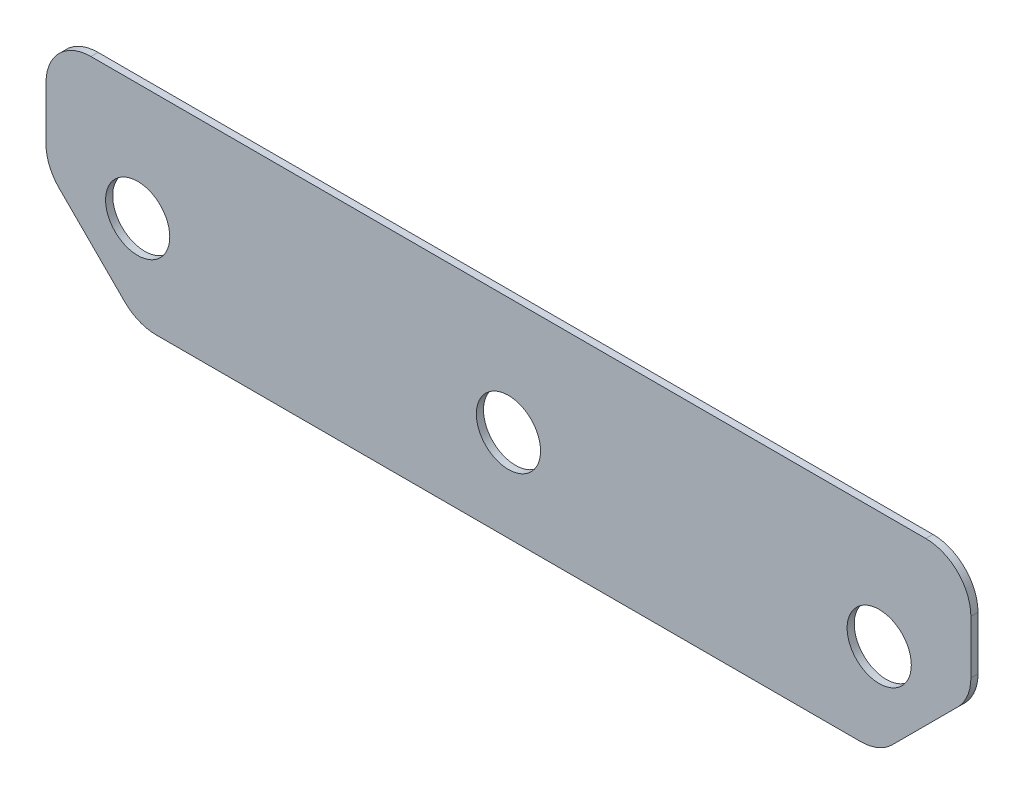
ISO-10303-21;
HEADER;
FILE_DESCRIPTION(('STEP AP214'),'2;1');
FILE_NAME('part.step','',(''),(''),'','','');
FILE_SCHEMA(('AUTOMOTIVE_DESIGN { 1 0 10303 214 1 1 1 1 }'));
ENDSEC;
DATA;
#1=APPLICATION_CONTEXT('core data for automotive mechanical design processes');
#2=APPLICATION_PROTOCOL_DEFINITION('international standard','automotive_design',2000,#1);
#3=PRODUCT_CONTEXT('',#1,'mechanical');
#4=PRODUCT('Part','Part','',(#3));
#5=PRODUCT_RELATED_PRODUCT_CATEGORY('part','',(#4));
#6=PRODUCT_DEFINITION_FORMATION('','',#4);
#7=PRODUCT_DEFINITION_CONTEXT('part definition',#1,'design');
#8=PRODUCT_DEFINITION('design','',#6,#7);
#9=PRODUCT_DEFINITION_SHAPE('','',#8);
#10=(LENGTH_UNIT() NAMED_UNIT(*) SI_UNIT(.MILLI.,.METRE.));
#11=(NAMED_UNIT(*) PLANE_ANGLE_UNIT() SI_UNIT($,.RADIAN.));
#12=(NAMED_UNIT(*) SI_UNIT($,.STERADIAN.) SOLID_ANGLE_UNIT());
#13=UNCERTAINTY_MEASURE_WITH_UNIT(LENGTH_MEASURE(1.E-05),#10,'distance_accuracy_value','');
#14=(GEOMETRIC_REPRESENTATION_CONTEXT(3) GLOBAL_UNCERTAINTY_ASSIGNED_CONTEXT((#13)) GLOBAL_UNIT_ASSIGNED_CONTEXT((#10,
#11,#12)) REPRESENTATION_CONTEXT('',''));
#15=CARTESIAN_POINT('',(0.,0.,0.));
#16=DIRECTION('',(0.,0.,1.));
#17=DIRECTION('',(1.,0.,0.));
#18=AXIS2_PLACEMENT_3D('',#15,#16,#17);
#19=CARTESIAN_POINT('',(-102.9119,-102.9119,3.175));
#20=DIRECTION('',(0.707106781186548,0.707106781186548,0.));
#21=DIRECTION('',(-0.707106781186548,0.707106781186548,0.));
#22=AXIS2_PLACEMENT_3D('',#19,#20,#21);
#23=PLANE('',#22);
#24=DIRECTION('',(0.707106781186548,-0.707106781186548,0.));
#25=VECTOR('',#24,1.);
#26=CARTESIAN_POINT('',(-102.9119,-102.9119,3.175));
#27=LINE('',#26,#25);
#28=CARTESIAN_POINT('',(-199.965935623731,-5.85786437626903,3.175));
#29=VERTEX_POINT('',#28);
#30=CARTESIAN_POINT('',(-170.881664376269,-34.9421356237309,3.175));
#31=VERTEX_POINT('',#30);
#32=EDGE_CURVE('E264',#29,#31,#27,.T.);
#33=ORIENTED_EDGE('',*,*,#32,.F.);
#34=DIRECTION('',(0.,0.,-1.));
#35=VECTOR('',#34,1.);
#36=CARTESIAN_POINT('',(-199.965935623731,-5.85786437626904,0.));
#37=LINE('',#36,#35);
#38=CARTESIAN_POINT('',(-199.965935623731,-5.85786437626903,0.));
#39=VERTEX_POINT('',#38);
#40=EDGE_CURVE('E191',#29,#39,#37,.T.);
#41=ORIENTED_EDGE('',*,*,#40,.T.);
#42=DIRECTION('',(0.707106781186548,-0.707106781186548,0.));
#43=VECTOR('',#42,1.);
#44=CARTESIAN_POINT('',(-102.9119,-102.9119,0.));
#45=LINE('',#44,#43);
#46=CARTESIAN_POINT('',(-170.881664376269,-34.9421356237309,0.));
#47=VERTEX_POINT('',#46);
#48=EDGE_CURVE('E249',#39,#47,#45,.T.);
#49=ORIENTED_EDGE('',*,*,#48,.T.);
#50=DIRECTION('',(0.,0.,-1.));
#51=VECTOR('',#50,1.);
#52=CARTESIAN_POINT('',(-170.881664376269,-34.942135623731,3.175));
#53=LINE('',#52,#51);
#54=EDGE_CURVE('E188',#47,#31,#53,.F.);
#55=ORIENTED_EDGE('',*,*,#54,.T.);
#56=EDGE_LOOP('',(#33,#41,#49,#55));
#57=FACE_BOUND('',#56,.T.);
#58=ADVANCED_FACE('F39',(#57),#23,.F.);
#59=CARTESIAN_POINT('',(0.,-40.8,3.175));
#60=DIRECTION('',(0.,1.,0.));
#61=DIRECTION('',(-1.,0.,0.));
#62=AXIS2_PLACEMENT_3D('',#59,#60,#61);
#63=PLANE('',#62);
#64=DIRECTION('',(1.,0.,0.));
#65=VECTOR('',#64,1.);
#66=CARTESIAN_POINT('',(0.,-40.8,3.175));
#67=LINE('',#66,#65);
#68=CARTESIAN_POINT('',(-156.739528752538,-40.8,3.175));
#69=VERTEX_POINT('',#68);
#70=CARTESIAN_POINT('',(156.739528752538,-40.7999999999999,3.175));
#71=VERTEX_POINT('',#70);
#72=EDGE_CURVE('E270',#69,#71,#67,.T.);
#73=ORIENTED_EDGE('',*,*,#72,.F.);
#74=DIRECTION('',(0.,0.,-1.));
#75=VECTOR('',#74,1.);
#76=CARTESIAN_POINT('',(-156.739528752538,-40.8,3.175));
#77=LINE('',#76,#75);
#78=CARTESIAN_POINT('',(-156.739528752538,-40.8,0.));
#79=VERTEX_POINT('',#78);
#80=EDGE_CURVE('E222',#69,#79,#77,.T.);
#81=ORIENTED_EDGE('',*,*,#80,.T.);
#82=DIRECTION('',(1.,0.,0.));
#83=VECTOR('',#82,1.);
#84=CARTESIAN_POINT('',(0.,-40.8,0.));
#85=LINE('',#84,#83);
#86=CARTESIAN_POINT('',(156.739528752538,-40.7999999999999,0.));
#87=VERTEX_POINT('',#86);
#88=EDGE_CURVE('E244',#79,#87,#85,.T.);
#89=ORIENTED_EDGE('',*,*,#88,.T.);
#90=DIRECTION('',(0.,0.,-1.));
#91=VECTOR('',#90,1.);
#92=CARTESIAN_POINT('',(156.739528752538,-40.7999999999999,3.175));
#93=LINE('',#92,#91);
#94=EDGE_CURVE('E219',#87,#71,#93,.F.);
#95=ORIENTED_EDGE('',*,*,#94,.T.);
#96=EDGE_LOOP('',(#73,#81,#89,#95));
#97=FACE_BOUND('',#96,.T.);
#98=ADVANCED_FACE('F306',(#97),#63,.F.);
#99=CARTESIAN_POINT('',(102.9119,-102.9119,3.175));
#100=DIRECTION('',(0.707106781186548,-0.707106781186548,0.));
#101=DIRECTION('',(0.707106781186548,0.707106781186548,0.));
#102=AXIS2_PLACEMENT_3D('',#99,#100,#101);
#103=PLANE('',#102);
#104=DIRECTION('',(-0.707106781186548,-0.707106781186548,0.));
#105=VECTOR('',#104,1.);
#106=CARTESIAN_POINT('',(102.9119,-102.9119,3.175));
#107=LINE('',#106,#105);
#108=CARTESIAN_POINT('',(199.965935623731,-5.85786437626899,3.175));
#109=VERTEX_POINT('',#108);
#110=CARTESIAN_POINT('',(170.881664376269,-34.9421356237309,3.175));
#111=VERTEX_POINT('',#110);
#112=EDGE_CURVE('E237',#109,#111,#107,.T.);
#113=ORIENTED_EDGE('',*,*,#112,.T.);
#114=DIRECTION('',(0.,0.,-1.));
#115=VECTOR('',#114,1.);
#116=CARTESIAN_POINT('',(170.881664376269,-34.9421356237309,0.));
#117=LINE('',#116,#115);
#118=CARTESIAN_POINT('',(170.881664376269,-34.9421356237309,0.));
#119=VERTEX_POINT('',#118);
#120=EDGE_CURVE('E48',#111,#119,#117,.T.);
#121=ORIENTED_EDGE('',*,*,#120,.T.);
#122=DIRECTION('',(-0.707106781186548,-0.707106781186548,0.));
#123=VECTOR('',#122,1.);
#124=CARTESIAN_POINT('',(102.9119,-102.9119,0.));
#125=LINE('',#124,#123);
#126=CARTESIAN_POINT('',(199.965935623731,-5.85786437626899,0.));
#127=VERTEX_POINT('',#126);
#128=EDGE_CURVE('E235',#127,#119,#125,.T.);
#129=ORIENTED_EDGE('',*,*,#128,.F.);
#130=DIRECTION('',(0.,0.,-1.));
#131=VECTOR('',#130,1.);
#132=CARTESIAN_POINT('',(199.965935623731,-5.85786437626901,3.175));
#133=LINE('',#132,#131);
#134=EDGE_CURVE('E226',#127,#109,#133,.F.);
#135=ORIENTED_EDGE('',*,*,#134,.T.);
#136=EDGE_LOOP('',(#113,#121,#129,#135));
#137=FACE_BOUND('',#136,.T.);
#138=ADVANCED_FACE('F234',(#137),#103,.T.);
#139=CARTESIAN_POINT('',(205.8238,0.,3.175));
#140=DIRECTION('',(1.,0.,0.));
#141=DIRECTION('',(0.,0.,-1.));
#142=AXIS2_PLACEMENT_3D('',#139,#140,#141);
#143=PLANE('',#142);
#144=DIRECTION('',(0.,-1.,0.));
#145=VECTOR('',#144,1.);
#146=CARTESIAN_POINT('',(205.8238,0.,3.175));
#147=LINE('',#146,#145);
#148=CARTESIAN_POINT('',(205.8238,32.,3.175));
#149=VERTEX_POINT('',#148);
#150=CARTESIAN_POINT('',(205.8238,8.28427124746196,3.175));
#151=VERTEX_POINT('',#150);
#152=EDGE_CURVE('E277',#149,#151,#147,.T.);
#153=ORIENTED_EDGE('',*,*,#152,.T.);
#154=DIRECTION('',(0.,0.,-1.));
#155=VECTOR('',#154,1.);
#156=CARTESIAN_POINT('',(205.8238,8.28427124746196,3.175));
#157=LINE('',#156,#155);
#158=CARTESIAN_POINT('',(205.8238,8.28427124746196,0.));
#159=VERTEX_POINT('',#158);
#160=EDGE_CURVE('E11',#151,#159,#157,.T.);
#161=ORIENTED_EDGE('',*,*,#160,.T.);
#162=DIRECTION('',(0.,-1.,0.));
#163=VECTOR('',#162,1.);
#164=CARTESIAN_POINT('',(205.8238,0.,0.));
#165=LINE('',#164,#163);
#166=CARTESIAN_POINT('',(205.8238,32.,0.));
#167=VERTEX_POINT('',#166);
#168=EDGE_CURVE('E243',#167,#159,#165,.T.);
#169=ORIENTED_EDGE('',*,*,#168,.F.);
#170=DIRECTION('',(0.,0.,-1.));
#171=VECTOR('',#170,1.);
#172=CARTESIAN_POINT('',(205.8238,32.,3.175));
#173=LINE('',#172,#171);
#174=EDGE_CURVE('E185',#167,#149,#173,.F.);
#175=ORIENTED_EDGE('',*,*,#174,.T.);
#176=EDGE_LOOP('',(#153,#161,#169,#175));
#177=FACE_BOUND('',#176,.T.);
#178=ADVANCED_FACE('F348',(#177),#143,.T.);
#179=CARTESIAN_POINT('',(0.,52.,3.175));
#180=DIRECTION('',(0.,1.,0.));
#181=DIRECTION('',(0.,0.,1.));
#182=AXIS2_PLACEMENT_3D('',#179,#180,#181);
#183=PLANE('',#182);
#184=DIRECTION('',(1.,0.,0.));
#185=VECTOR('',#184,1.);
#186=CARTESIAN_POINT('',(0.,52.,0.));
#187=LINE('',#186,#185);
#188=CARTESIAN_POINT('',(-185.8238,52.,0.));
#189=VERTEX_POINT('',#188);
#190=CARTESIAN_POINT('',(185.8238,52.,0.));
#191=VERTEX_POINT('',#190);
#192=EDGE_CURVE('E144',#189,#191,#187,.T.);
#193=ORIENTED_EDGE('',*,*,#192,.F.);
#194=DIRECTION('',(0.,0.,-1.));
#195=VECTOR('',#194,1.);
#196=CARTESIAN_POINT('',(-185.8238,52.,3.175));
#197=LINE('',#196,#195);
#198=CARTESIAN_POINT('',(-185.8238,52.,3.175));
#199=VERTEX_POINT('',#198);
#200=EDGE_CURVE('E152',#189,#199,#197,.F.);
#201=ORIENTED_EDGE('',*,*,#200,.T.);
#202=DIRECTION('',(1.,0.,0.));
#203=VECTOR('',#202,1.);
#204=CARTESIAN_POINT('',(0.,52.,3.175));
#205=LINE('',#204,#203);
#206=CARTESIAN_POINT('',(185.8238,52.,3.175));
#207=VERTEX_POINT('',#206);
#208=EDGE_CURVE('E280',#199,#207,#205,.T.);
#209=ORIENTED_EDGE('',*,*,#208,.T.);
#210=DIRECTION('',(0.,0.,-1.));
#211=VECTOR('',#210,1.);
#212=CARTESIAN_POINT('',(185.8238,52.,3.175));
#213=LINE('',#212,#211);
#214=EDGE_CURVE('E154',#207,#191,#213,.T.);
#215=ORIENTED_EDGE('',*,*,#214,.T.);
#216=EDGE_LOOP('',(#193,#201,#209,#215));
#217=FACE_BOUND('',#216,.T.);
#218=ADVANCED_FACE('F344',(#217),#183,.T.);
#219=CARTESIAN_POINT('',(0.,0.,3.175));
#220=DIRECTION('',(0.,0.,-1.));
#221=DIRECTION('',(-1.,0.,0.));
#222=AXIS2_PLACEMENT_3D('',#219,#220,#221);
#223=CYLINDRICAL_SURFACE('',#222,14.2875);
#224=CARTESIAN_POINT('',(0.,0.,3.175));
#225=DIRECTION('',(0.,0.,1.));
#226=DIRECTION('',(1.,0.,0.));
#227=AXIS2_PLACEMENT_3D('',#224,#225,#226);
#228=CIRCLE('',#227,14.2875);
#229=CARTESIAN_POINT('',(14.2875,0.,3.175));
#230=VERTEX_POINT('',#229);
#231=EDGE_CURVE('E168',#230,#230,#228,.T.);
#232=ORIENTED_EDGE('',*,*,#231,.T.);
#233=EDGE_LOOP('',(#232));
#234=FACE_BOUND('',#233,.T.);
#235=CARTESIAN_POINT('',(0.,0.,0.));
#236=DIRECTION('',(0.,0.,1.));
#237=DIRECTION('',(1.,0.,0.));
#238=AXIS2_PLACEMENT_3D('',#235,#236,#237);
#239=CIRCLE('',#238,14.2875);
#240=CARTESIAN_POINT('',(14.2875,0.,0.));
#241=VERTEX_POINT('',#240);
#242=EDGE_CURVE('E143',#241,#241,#239,.T.);
#243=ORIENTED_EDGE('',*,*,#242,.F.);
#244=EDGE_LOOP('',(#243));
#245=FACE_BOUND('',#244,.T.);
#246=ADVANCED_FACE('F356',(#234,#245),#223,.F.);
#247=CARTESIAN_POINT('',(-205.8238,0.,3.175));
#248=DIRECTION('',(-1.,0.,0.));
#249=DIRECTION('',(0.,0.,1.));
#250=AXIS2_PLACEMENT_3D('',#247,#248,#249);
#251=PLANE('',#250);
#252=DIRECTION('',(0.,1.,0.));
#253=VECTOR('',#252,1.);
#254=CARTESIAN_POINT('',(-205.8238,0.,0.));
#255=LINE('',#254,#253);
#256=CARTESIAN_POINT('',(-205.8238,8.28427124746192,0.));
#257=VERTEX_POINT('',#256);
#258=CARTESIAN_POINT('',(-205.8238,32.,0.));
#259=VERTEX_POINT('',#258);
#260=EDGE_CURVE('E130',#257,#259,#255,.T.);
#261=ORIENTED_EDGE('',*,*,#260,.F.);
#262=DIRECTION('',(0.,0.,-1.));
#263=VECTOR('',#262,1.);
#264=CARTESIAN_POINT('',(-205.8238,8.28427124746192,3.175));
#265=LINE('',#264,#263);
#266=CARTESIAN_POINT('',(-205.8238,8.28427124746192,3.175));
#267=VERTEX_POINT('',#266);
#268=EDGE_CURVE('E206',#257,#267,#265,.F.);
#269=ORIENTED_EDGE('',*,*,#268,.T.);
#270=DIRECTION('',(0.,1.,0.));
#271=VECTOR('',#270,1.);
#272=CARTESIAN_POINT('',(-205.8238,0.,3.175));
#273=LINE('',#272,#271);
#274=CARTESIAN_POINT('',(-205.8238,32.,3.175));
#275=VERTEX_POINT('',#274);
#276=EDGE_CURVE('E159',#267,#275,#273,.T.);
#277=ORIENTED_EDGE('',*,*,#276,.T.);
#278=DIRECTION('',(0.,0.,-1.));
#279=VECTOR('',#278,1.);
#280=CARTESIAN_POINT('',(-205.8238,32.,3.175));
#281=LINE('',#280,#279);
#282=EDGE_CURVE('E151',#275,#259,#281,.T.);
#283=ORIENTED_EDGE('',*,*,#282,.T.);
#284=EDGE_LOOP('',(#261,#269,#277,#283));
#285=FACE_BOUND('',#284,.T.);
#286=ADVANCED_FACE('F157',(#285),#251,.T.);
#287=CARTESIAN_POINT('',(-165.0238,0.,3.175));
#288=DIRECTION('',(0.,0.,-1.));
#289=DIRECTION('',(-1.,0.,0.));
#290=AXIS2_PLACEMENT_3D('',#287,#288,#289);
#291=CYLINDRICAL_SURFACE('',#290,14.2875);
#292=CARTESIAN_POINT('',(-165.0238,0.,3.175));
#293=DIRECTION('',(0.,0.,1.));
#294=DIRECTION('',(1.,0.,0.));
#295=AXIS2_PLACEMENT_3D('',#292,#293,#294);
#296=CIRCLE('',#295,14.2875);
#297=CARTESIAN_POINT('',(-150.7363,0.,3.175));
#298=VERTEX_POINT('',#297);
#299=EDGE_CURVE('E259',#298,#298,#296,.T.);
#300=ORIENTED_EDGE('',*,*,#299,.T.);
#301=EDGE_LOOP('',(#300));
#302=FACE_BOUND('',#301,.T.);
#303=CARTESIAN_POINT('',(-165.0238,0.,0.));
#304=DIRECTION('',(0.,0.,1.));
#305=DIRECTION('',(1.,0.,0.));
#306=AXIS2_PLACEMENT_3D('',#303,#304,#305);
#307=CIRCLE('',#306,14.2875);
#308=CARTESIAN_POINT('',(-150.7363,0.,0.));
#309=VERTEX_POINT('',#308);
#310=EDGE_CURVE('E289',#309,#309,#307,.T.);
#311=ORIENTED_EDGE('',*,*,#310,.F.);
#312=EDGE_LOOP('',(#311));
#313=FACE_BOUND('',#312,.T.);
#314=ADVANCED_FACE('F325',(#302,#313),#291,.F.);
#315=CARTESIAN_POINT('',(165.0238,0.,3.175));
#316=DIRECTION('',(0.,0.,-1.));
#317=DIRECTION('',(-1.,0.,0.));
#318=AXIS2_PLACEMENT_3D('',#315,#316,#317);
#319=CYLINDRICAL_SURFACE('',#318,14.2875);
#320=CARTESIAN_POINT('',(165.0238,0.,3.175));
#321=DIRECTION('',(0.,0.,1.));
#322=DIRECTION('',(1.,0.,0.));
#323=AXIS2_PLACEMENT_3D('',#320,#321,#322);
#324=CIRCLE('',#323,14.2875);
#325=CARTESIAN_POINT('',(179.3113,0.,3.175));
#326=VERTEX_POINT('',#325);
#327=EDGE_CURVE('E162',#326,#326,#324,.T.);
#328=ORIENTED_EDGE('',*,*,#327,.T.);
#329=EDGE_LOOP('',(#328));
#330=FACE_BOUND('',#329,.T.);
#331=CARTESIAN_POINT('',(165.0238,0.,0.));
#332=DIRECTION('',(0.,0.,1.));
#333=DIRECTION('',(1.,0.,0.));
#334=AXIS2_PLACEMENT_3D('',#331,#332,#333);
#335=CIRCLE('',#334,14.2875);
#336=CARTESIAN_POINT('',(179.3113,0.,0.));
#337=VERTEX_POINT('',#336);
#338=EDGE_CURVE('E171',#337,#337,#335,.T.);
#339=ORIENTED_EDGE('',*,*,#338,.F.);
#340=EDGE_LOOP('',(#339));
#341=FACE_BOUND('',#340,.T.);
#342=ADVANCED_FACE('F328',(#330,#341),#319,.F.);
#343=CARTESIAN_POINT('',(0.,0.,3.175));
#344=DIRECTION('',(0.,0.,1.));
#345=DIRECTION('',(1.,0.,0.));
#346=AXIS2_PLACEMENT_3D('',#343,#344,#345);
#347=PLANE('',#346);
#348=ORIENTED_EDGE('',*,*,#299,.F.);
#349=EDGE_LOOP('',(#348));
#350=FACE_BOUND('',#349,.T.);
#351=ORIENTED_EDGE('',*,*,#276,.F.);
#352=CARTESIAN_POINT('',(-185.8238,8.28427124746192,3.175));
#353=DIRECTION('',(0.,0.,1.));
#354=DIRECTION('',(1.,0.,0.));
#355=AXIS2_PLACEMENT_3D('',#352,#353,#354);
#356=CIRCLE('',#355,20.);
#357=EDGE_CURVE('E216',#267,#29,#356,.T.);
#358=ORIENTED_EDGE('',*,*,#357,.T.);
#359=ORIENTED_EDGE('',*,*,#32,.T.);
#360=CARTESIAN_POINT('',(-156.739528752538,-20.8,3.175));
#361=DIRECTION('',(0.,0.,1.));
#362=DIRECTION('',(1.,0.,0.));
#363=AXIS2_PLACEMENT_3D('',#360,#361,#362);
#364=CIRCLE('',#363,20.);
#365=EDGE_CURVE('E213',#31,#69,#364,.T.);
#366=ORIENTED_EDGE('',*,*,#365,.T.);
#367=ORIENTED_EDGE('',*,*,#72,.T.);
#368=CARTESIAN_POINT('',(156.739528752538,-20.7999999999999,3.175));
#369=DIRECTION('',(0.,0.,1.));
#370=DIRECTION('',(1.,0.,0.));
#371=AXIS2_PLACEMENT_3D('',#368,#369,#370);
#372=CIRCLE('',#371,20.);
#373=EDGE_CURVE('E61',#71,#111,#372,.T.);
#374=ORIENTED_EDGE('',*,*,#373,.T.);
#375=ORIENTED_EDGE('',*,*,#112,.F.);
#376=CARTESIAN_POINT('',(185.8238,8.28427124746196,3.175));
#377=DIRECTION('',(0.,0.,1.));
#378=DIRECTION('',(1.,0.,0.));
#379=AXIS2_PLACEMENT_3D('',#376,#377,#378);
#380=CIRCLE('',#379,20.);
#381=EDGE_CURVE('E55',#109,#151,#380,.T.);
#382=ORIENTED_EDGE('',*,*,#381,.T.);
#383=ORIENTED_EDGE('',*,*,#152,.F.);
#384=CARTESIAN_POINT('',(185.8238,32.,3.175));
#385=DIRECTION('',(0.,0.,1.));
#386=DIRECTION('',(1.,0.,0.));
#387=AXIS2_PLACEMENT_3D('',#384,#385,#386);
#388=CIRCLE('',#387,20.);
#389=EDGE_CURVE('E179',#149,#207,#388,.T.);
#390=ORIENTED_EDGE('',*,*,#389,.T.);
#391=ORIENTED_EDGE('',*,*,#208,.F.);
#392=CARTESIAN_POINT('',(-185.8238,32.,3.175));
#393=DIRECTION('',(0.,0.,1.));
#394=DIRECTION('',(1.,0.,0.));
#395=AXIS2_PLACEMENT_3D('',#392,#393,#394);
#396=CIRCLE('',#395,20.);
#397=EDGE_CURVE('E182',#199,#275,#396,.T.);
#398=ORIENTED_EDGE('',*,*,#397,.T.);
#399=EDGE_LOOP('',(#351,#358,#359,#366,#367,#374,#375,#382,#383,#390,#391,#398));
#400=FACE_BOUND('',#399,.T.);
#401=ORIENTED_EDGE('',*,*,#231,.F.);
#402=EDGE_LOOP('',(#401));
#403=FACE_BOUND('',#402,.T.);
#404=ORIENTED_EDGE('',*,*,#327,.F.);
#405=EDGE_LOOP('',(#404));
#406=FACE_BOUND('',#405,.T.);
#407=ADVANCED_FACE('F303',(#350,#400,#403,#406),#347,.T.);
#408=CARTESIAN_POINT('',(0.,0.,0.));
#409=DIRECTION('',(0.,0.,1.));
#410=DIRECTION('',(1.,0.,0.));
#411=AXIS2_PLACEMENT_3D('',#408,#409,#410);
#412=PLANE('',#411);
#413=ORIENTED_EDGE('',*,*,#310,.T.);
#414=EDGE_LOOP('',(#413));
#415=FACE_BOUND('',#414,.T.);
#416=ORIENTED_EDGE('',*,*,#48,.F.);
#417=CARTESIAN_POINT('',(-185.8238,8.28427124746192,0.));
#418=DIRECTION('',(0.,0.,1.));
#419=DIRECTION('',(1.,0.,0.));
#420=AXIS2_PLACEMENT_3D('',#417,#418,#419);
#421=CIRCLE('',#420,20.);
#422=EDGE_CURVE('E138',#39,#257,#421,.F.);
#423=ORIENTED_EDGE('',*,*,#422,.T.);
#424=ORIENTED_EDGE('',*,*,#260,.T.);
#425=CARTESIAN_POINT('',(-185.8238,32.,0.));
#426=DIRECTION('',(0.,0.,1.));
#427=DIRECTION('',(1.,0.,0.));
#428=AXIS2_PLACEMENT_3D('',#425,#426,#427);
#429=CIRCLE('',#428,20.);
#430=EDGE_CURVE('E136',#259,#189,#429,.F.);
#431=ORIENTED_EDGE('',*,*,#430,.T.);
#432=ORIENTED_EDGE('',*,*,#192,.T.);
#433=CARTESIAN_POINT('',(185.8238,32.,0.));
#434=DIRECTION('',(0.,0.,1.));
#435=DIRECTION('',(1.,0.,0.));
#436=AXIS2_PLACEMENT_3D('',#433,#434,#435);
#437=CIRCLE('',#436,20.);
#438=EDGE_CURVE('E155',#191,#167,#437,.F.);
#439=ORIENTED_EDGE('',*,*,#438,.T.);
#440=ORIENTED_EDGE('',*,*,#168,.T.);
#441=CARTESIAN_POINT('',(185.8238,8.28427124746196,0.));
#442=DIRECTION('',(0.,0.,1.));
#443=DIRECTION('',(1.,0.,0.));
#444=AXIS2_PLACEMENT_3D('',#441,#442,#443);
#445=CIRCLE('',#444,20.);
#446=EDGE_CURVE('E195',#159,#127,#445,.F.);
#447=ORIENTED_EDGE('',*,*,#446,.T.);
#448=ORIENTED_EDGE('',*,*,#128,.T.);
#449=CARTESIAN_POINT('',(156.739528752538,-20.7999999999999,0.));
#450=DIRECTION('',(0.,0.,1.));
#451=DIRECTION('',(1.,0.,0.));
#452=AXIS2_PLACEMENT_3D('',#449,#450,#451);
#453=CIRCLE('',#452,20.);
#454=EDGE_CURVE('E198',#119,#87,#453,.F.);
#455=ORIENTED_EDGE('',*,*,#454,.T.);
#456=ORIENTED_EDGE('',*,*,#88,.F.);
#457=CARTESIAN_POINT('',(-156.739528752538,-20.8,0.));
#458=DIRECTION('',(0.,0.,1.));
#459=DIRECTION('',(1.,0.,0.));
#460=AXIS2_PLACEMENT_3D('',#457,#458,#459);
#461=CIRCLE('',#460,20.);
#462=EDGE_CURVE('E201',#79,#47,#461,.F.);
#463=ORIENTED_EDGE('',*,*,#462,.T.);
#464=EDGE_LOOP('',(#416,#423,#424,#431,#432,#439,#440,#447,#448,#455,#456,#463));
#465=FACE_BOUND('',#464,.T.);
#466=ORIENTED_EDGE('',*,*,#242,.T.);
#467=EDGE_LOOP('',(#466));
#468=FACE_BOUND('',#467,.T.);
#469=ORIENTED_EDGE('',*,*,#338,.T.);
#470=EDGE_LOOP('',(#469));
#471=FACE_BOUND('',#470,.T.);
#472=ADVANCED_FACE('F133',(#415,#465,#468,#471),#412,.F.);
#473=CARTESIAN_POINT('',(-185.8238,32.,3.175));
#474=DIRECTION('',(0.,0.,-1.));
#475=DIRECTION('',(-1.,0.,0.));
#476=AXIS2_PLACEMENT_3D('',#473,#474,#475);
#477=CYLINDRICAL_SURFACE('',#476,20.);
#478=ORIENTED_EDGE('',*,*,#397,.F.);
#479=ORIENTED_EDGE('',*,*,#200,.F.);
#480=ORIENTED_EDGE('',*,*,#430,.F.);
#481=ORIENTED_EDGE('',*,*,#282,.F.);
#482=EDGE_LOOP('',(#478,#479,#480,#481));
#483=FACE_BOUND('',#482,.T.);
#484=ADVANCED_FACE('F150',(#483),#477,.T.);
#485=CARTESIAN_POINT('',(185.8238,32.,3.175));
#486=DIRECTION('',(0.,0.,-1.));
#487=DIRECTION('',(-1.,0.,0.));
#488=AXIS2_PLACEMENT_3D('',#485,#486,#487);
#489=CYLINDRICAL_SURFACE('',#488,20.);
#490=ORIENTED_EDGE('',*,*,#389,.F.);
#491=ORIENTED_EDGE('',*,*,#174,.F.);
#492=ORIENTED_EDGE('',*,*,#438,.F.);
#493=ORIENTED_EDGE('',*,*,#214,.F.);
#494=EDGE_LOOP('',(#490,#491,#492,#493));
#495=FACE_BOUND('',#494,.T.);
#496=ADVANCED_FACE('F331',(#495),#489,.T.);
#497=CARTESIAN_POINT('',(-185.8238,8.28427124746192,3.175));
#498=DIRECTION('',(0.,0.,1.));
#499=DIRECTION('',(1.,0.,0.));
#500=AXIS2_PLACEMENT_3D('',#497,#498,#499);
#501=CYLINDRICAL_SURFACE('',#500,20.);
#502=ORIENTED_EDGE('',*,*,#357,.F.);
#503=ORIENTED_EDGE('',*,*,#268,.F.);
#504=ORIENTED_EDGE('',*,*,#422,.F.);
#505=ORIENTED_EDGE('',*,*,#40,.F.);
#506=EDGE_LOOP('',(#502,#503,#504,#505));
#507=FACE_BOUND('',#506,.T.);
#508=ADVANCED_FACE('F315',(#507),#501,.T.);
#509=CARTESIAN_POINT('',(-156.739528752538,-20.8,3.175));
#510=DIRECTION('',(0.,0.,-1.));
#511=DIRECTION('',(-1.,0.,0.));
#512=AXIS2_PLACEMENT_3D('',#509,#510,#511);
#513=CYLINDRICAL_SURFACE('',#512,20.);
#514=ORIENTED_EDGE('',*,*,#365,.F.);
#515=ORIENTED_EDGE('',*,*,#54,.F.);
#516=ORIENTED_EDGE('',*,*,#462,.F.);
#517=ORIENTED_EDGE('',*,*,#80,.F.);
#518=EDGE_LOOP('',(#514,#515,#516,#517));
#519=FACE_BOUND('',#518,.T.);
#520=ADVANCED_FACE('F300',(#519),#513,.T.);
#521=CARTESIAN_POINT('',(156.739528752538,-20.7999999999999,3.175));
#522=DIRECTION('',(0.,0.,1.));
#523=DIRECTION('',(1.,0.,0.));
#524=AXIS2_PLACEMENT_3D('',#521,#522,#523);
#525=CYLINDRICAL_SURFACE('',#524,20.);
#526=ORIENTED_EDGE('',*,*,#373,.F.);
#527=ORIENTED_EDGE('',*,*,#94,.F.);
#528=ORIENTED_EDGE('',*,*,#454,.F.);
#529=ORIENTED_EDGE('',*,*,#120,.F.);
#530=EDGE_LOOP('',(#526,#527,#528,#529));
#531=FACE_BOUND('',#530,.T.);
#532=ADVANCED_FACE('F308',(#531),#525,.T.);
#533=CARTESIAN_POINT('',(185.8238,8.28427124746196,3.175));
#534=DIRECTION('',(0.,0.,-1.));
#535=DIRECTION('',(-1.,0.,0.));
#536=AXIS2_PLACEMENT_3D('',#533,#534,#535);
#537=CYLINDRICAL_SURFACE('',#536,20.);
#538=ORIENTED_EDGE('',*,*,#381,.F.);
#539=ORIENTED_EDGE('',*,*,#134,.F.);
#540=ORIENTED_EDGE('',*,*,#446,.F.);
#541=ORIENTED_EDGE('',*,*,#160,.F.);
#542=EDGE_LOOP('',(#538,#539,#540,#541));
#543=FACE_BOUND('',#542,.T.);
#544=ADVANCED_FACE('F41',(#543),#537,.T.);
#545=CLOSED_SHELL('',(#58,#98,#138,#178,#218,#246,#286,#314,#342,#407,#472,#484,#496,#508,#520,
#532,#544));
#546=MANIFOLD_SOLID_BREP('B2',#545);
#547=ADVANCED_BREP_SHAPE_REPRESENTATION('',(#18,#546),#14);
#548=SHAPE_DEFINITION_REPRESENTATION(#9,#547);
ENDSEC;
END-ISO-10303-21;
